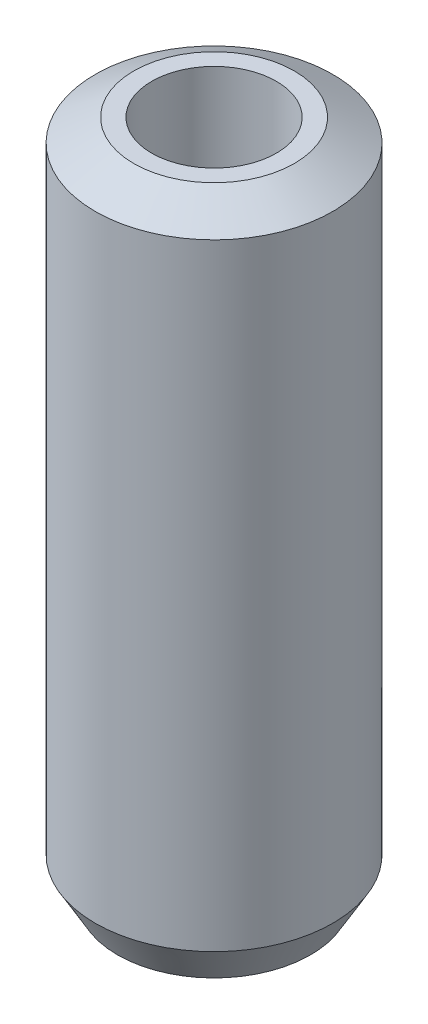
ISO-10303-21;
HEADER;
FILE_DESCRIPTION(('STEP AP214'),'2;1');
FILE_NAME('part.step','',(''),(''),'','','');
FILE_SCHEMA(('AUTOMOTIVE_DESIGN { 1 0 10303 214 1 1 1 1 }'));
ENDSEC;
DATA;
#1=APPLICATION_CONTEXT('core data for automotive mechanical design processes');
#2=APPLICATION_PROTOCOL_DEFINITION('international standard','automotive_design',2000,#1);
#3=PRODUCT_CONTEXT('',#1,'mechanical');
#4=PRODUCT('Part','Part','',(#3));
#5=PRODUCT_RELATED_PRODUCT_CATEGORY('part','',(#4));
#6=PRODUCT_DEFINITION_FORMATION('','',#4);
#7=PRODUCT_DEFINITION_CONTEXT('part definition',#1,'design');
#8=PRODUCT_DEFINITION('design','',#6,#7);
#9=PRODUCT_DEFINITION_SHAPE('','',#8);
#10=(LENGTH_UNIT() NAMED_UNIT(*) SI_UNIT(.MILLI.,.METRE.));
#11=(NAMED_UNIT(*) PLANE_ANGLE_UNIT() SI_UNIT($,.RADIAN.));
#12=(NAMED_UNIT(*) SI_UNIT($,.STERADIAN.) SOLID_ANGLE_UNIT());
#13=UNCERTAINTY_MEASURE_WITH_UNIT(LENGTH_MEASURE(1.E-05),#10,'distance_accuracy_value','');
#14=(GEOMETRIC_REPRESENTATION_CONTEXT(3) GLOBAL_UNCERTAINTY_ASSIGNED_CONTEXT((#13)) GLOBAL_UNIT_ASSIGNED_CONTEXT((#10,
#11,#12)) REPRESENTATION_CONTEXT('',''));
#15=CARTESIAN_POINT('',(0.,0.,0.));
#16=DIRECTION('',(0.,0.,1.));
#17=DIRECTION('',(1.,0.,0.));
#18=AXIS2_PLACEMENT_3D('',#15,#16,#17);
#19=CARTESIAN_POINT('',(0.,28.5071155681432,0.));
#20=DIRECTION('',(0.,-1.,0.));
#21=DIRECTION('',(0.,0.,-1.));
#22=AXIS2_PLACEMENT_3D('',#19,#20,#21);
#23=CYLINDRICAL_SURFACE('',#22,5.);
#24=CARTESIAN_POINT('',(0.,27.5709840578687,0.));
#25=DIRECTION('',(0.,1.,0.));
#26=DIRECTION('',(0.,0.,1.));
#27=AXIS2_PLACEMENT_3D('',#24,#25,#26);
#28=CIRCLE('',#27,5.);
#29=CARTESIAN_POINT('',(0.,27.5709840578687,5.));
#30=VERTEX_POINT('',#29);
#31=EDGE_CURVE('E50',#30,#30,#28,.F.);
#32=ORIENTED_EDGE('',*,*,#31,.T.);
#33=EDGE_LOOP('',(#32));
#34=FACE_BOUND('',#33,.T.);
#35=CARTESIAN_POINT('',(0.,1.62142733836166,0.));
#36=DIRECTION('',(0.,1.,0.));
#37=DIRECTION('',(0.,0.,1.));
#38=AXIS2_PLACEMENT_3D('',#35,#36,#37);
#39=CIRCLE('',#38,5.);
#40=CARTESIAN_POINT('',(0.,1.62142733836166,5.));
#41=VERTEX_POINT('',#40);
#42=EDGE_CURVE('E51',#41,#41,#39,.T.);
#43=ORIENTED_EDGE('',*,*,#42,.T.);
#44=EDGE_LOOP('',(#43));
#45=FACE_BOUND('',#44,.T.);
#46=ADVANCED_FACE('F39',(#34,#45),#23,.T.);
#47=CARTESIAN_POINT('',(0.,28.5071155681432,0.));
#48=DIRECTION('',(0.,1.,0.));
#49=DIRECTION('',(0.,0.,1.));
#50=AXIS2_PLACEMENT_3D('',#47,#48,#49);
#51=PLANE('',#50);
#52=CARTESIAN_POINT('',(0.,28.5071155681432,0.));
#53=DIRECTION('',(0.,1.,0.));
#54=DIRECTION('',(0.,0.,1.));
#55=AXIS2_PLACEMENT_3D('',#52,#53,#54);
#56=CIRCLE('',#55,3.37857266163833);
#57=CARTESIAN_POINT('',(0.,28.5071155681432,3.37857266163833));
#58=VERTEX_POINT('',#57);
#59=EDGE_CURVE('E54',#58,#58,#56,.T.);
#60=ORIENTED_EDGE('',*,*,#59,.T.);
#61=EDGE_LOOP('',(#60));
#62=FACE_BOUND('',#61,.T.);
#63=CARTESIAN_POINT('',(0.,28.5071155681432,0.));
#64=DIRECTION('',(0.,1.,0.));
#65=DIRECTION('',(0.,0.,1.));
#66=AXIS2_PLACEMENT_3D('',#63,#64,#65);
#67=CIRCLE('',#66,2.62371184397481);
#68=CARTESIAN_POINT('',(0.,28.5071155681432,2.62371184397481));
#69=VERTEX_POINT('',#68);
#70=EDGE_CURVE('E58',#69,#69,#67,.T.);
#71=ORIENTED_EDGE('',*,*,#70,.F.);
#72=EDGE_LOOP('',(#71));
#73=FACE_BOUND('',#72,.T.);
#74=ADVANCED_FACE('F69',(#62,#73),#51,.T.);
#75=CARTESIAN_POINT('',(0.,0.,0.));
#76=DIRECTION('',(0.,1.,0.));
#77=DIRECTION('',(0.,0.,1.));
#78=AXIS2_PLACEMENT_3D('',#75,#76,#77);
#79=PLANE('',#78);
#80=CARTESIAN_POINT('',(0.,0.,0.));
#81=DIRECTION('',(0.,1.,0.));
#82=DIRECTION('',(0.,0.,1.));
#83=AXIS2_PLACEMENT_3D('',#80,#81,#82);
#84=CIRCLE('',#83,4.06386848972547);
#85=CARTESIAN_POINT('',(0.,0.,4.06386848972547));
#86=VERTEX_POINT('',#85);
#87=EDGE_CURVE('E10',#86,#86,#84,.F.);
#88=ORIENTED_EDGE('',*,*,#87,.T.);
#89=EDGE_LOOP('',(#88));
#90=FACE_BOUND('',#89,.T.);
#91=CARTESIAN_POINT('',(0.,0.,0.));
#92=DIRECTION('',(0.,1.,0.));
#93=DIRECTION('',(0.,0.,1.));
#94=AXIS2_PLACEMENT_3D('',#91,#92,#93);
#95=CIRCLE('',#94,2.62371184397481);
#96=CARTESIAN_POINT('',(0.,0.,2.62371184397481));
#97=VERTEX_POINT('',#96);
#98=EDGE_CURVE('E63',#97,#97,#95,.T.);
#99=ORIENTED_EDGE('',*,*,#98,.T.);
#100=EDGE_LOOP('',(#99));
#101=FACE_BOUND('',#100,.T.);
#102=ADVANCED_FACE('F75',(#90,#101),#79,.F.);
#103=CARTESIAN_POINT('',(0.,28.5071155681432,0.));
#104=DIRECTION('',(0.,-1.,0.));
#105=DIRECTION('',(0.,0.,-1.));
#106=AXIS2_PLACEMENT_3D('',#103,#104,#105);
#107=CYLINDRICAL_SURFACE('',#106,2.62371184397481);
#108=ORIENTED_EDGE('',*,*,#70,.T.);
#109=EDGE_LOOP('',(#108));
#110=FACE_BOUND('',#109,.T.);
#111=ORIENTED_EDGE('',*,*,#98,.F.);
#112=EDGE_LOOP('',(#111));
#113=FACE_BOUND('',#112,.T.);
#114=ADVANCED_FACE('F70',(#110,#113),#107,.F.);
#115=CARTESIAN_POINT('',(0.,28.5071155681432,0.));
#116=DIRECTION('',(0.,-1.,0.));
#117=DIRECTION('',(0.,0.,-1.));
#118=AXIS2_PLACEMENT_3D('',#115,#116,#117);
#119=CONICAL_SURFACE('',#118,3.37857266163833,1.04719755119659);
#120=ORIENTED_EDGE('',*,*,#31,.F.);
#121=EDGE_LOOP('',(#120));
#122=FACE_BOUND('',#121,.T.);
#123=ORIENTED_EDGE('',*,*,#59,.F.);
#124=EDGE_LOOP('',(#123));
#125=FACE_BOUND('',#124,.T.);
#126=ADVANCED_FACE('F81',(#122,#125),#119,.T.);
#127=CARTESIAN_POINT('',(0.,1.62142733836166,0.));
#128=DIRECTION('',(0.,1.,0.));
#129=DIRECTION('',(0.,0.,1.));
#130=AXIS2_PLACEMENT_3D('',#127,#128,#129);
#131=CONICAL_SURFACE('',#130,5.,0.523598775598301);
#132=ORIENTED_EDGE('',*,*,#87,.F.);
#133=EDGE_LOOP('',(#132));
#134=FACE_BOUND('',#133,.T.);
#135=ORIENTED_EDGE('',*,*,#42,.F.);
#136=EDGE_LOOP('',(#135));
#137=FACE_BOUND('',#136,.T.);
#138=ADVANCED_FACE('F45',(#134,#137),#131,.T.);
#139=CLOSED_SHELL('',(#46,#74,#102,#114,#126,#138));
#140=MANIFOLD_SOLID_BREP('B2',#139);
#141=ADVANCED_BREP_SHAPE_REPRESENTATION('',(#18,#140),#14);
#142=SHAPE_DEFINITION_REPRESENTATION(#9,#141);
ENDSEC;
END-ISO-10303-21;
